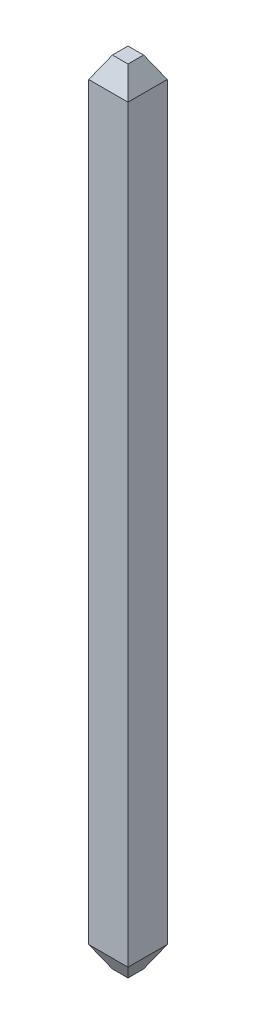
ISO-10303-21;
HEADER;
FILE_DESCRIPTION(('STEP AP214'),'2;1');
FILE_NAME('part.step','',(''),(''),'','','');
FILE_SCHEMA(('AUTOMOTIVE_DESIGN { 1 0 10303 214 1 1 1 1 }'));
ENDSEC;
DATA;
#1=APPLICATION_CONTEXT('core data for automotive mechanical design processes');
#2=APPLICATION_PROTOCOL_DEFINITION('international standard','automotive_design',2000,#1);
#3=PRODUCT_CONTEXT('',#1,'mechanical');
#4=PRODUCT('Part','Part','',(#3));
#5=PRODUCT_RELATED_PRODUCT_CATEGORY('part','',(#4));
#6=PRODUCT_DEFINITION_FORMATION('','',#4);
#7=PRODUCT_DEFINITION_CONTEXT('part definition',#1,'design');
#8=PRODUCT_DEFINITION('design','',#6,#7);
#9=PRODUCT_DEFINITION_SHAPE('','',#8);
#10=(LENGTH_UNIT() NAMED_UNIT(*) SI_UNIT(.MILLI.,.METRE.));
#11=(NAMED_UNIT(*) PLANE_ANGLE_UNIT() SI_UNIT($,.RADIAN.));
#12=(NAMED_UNIT(*) SI_UNIT($,.STERADIAN.) SOLID_ANGLE_UNIT());
#13=UNCERTAINTY_MEASURE_WITH_UNIT(LENGTH_MEASURE(1.E-05),#10,'distance_accuracy_value','');
#14=(GEOMETRIC_REPRESENTATION_CONTEXT(3) GLOBAL_UNCERTAINTY_ASSIGNED_CONTEXT((#13)) GLOBAL_UNIT_ASSIGNED_CONTEXT((#10,
#11,#12)) REPRESENTATION_CONTEXT('',''));
#15=CARTESIAN_POINT('',(0.,0.,0.));
#16=DIRECTION('',(0.,0.,1.));
#17=DIRECTION('',(1.,0.,0.));
#18=AXIS2_PLACEMENT_3D('',#15,#16,#17);
#19=CARTESIAN_POINT('',(0.497289871213,-21.22226807941,-0.290960592368));
#20=DIRECTION('',(0.,0.488489958076213,0.87256951634738));
#21=DIRECTION('',(0.,-0.87256951634738,0.488489958076213));
#22=AXIS2_PLACEMENT_3D('',#19,#20,#21);
#23=PLANE('',#22);
#24=DIRECTION('',(1.,0.,0.));
#25=VECTOR('',#24,1.);
#26=CARTESIAN_POINT('',(0.497289871213,-21.57099360271,-0.0957338361422407));
#27=LINE('',#26,#25);
#28=CARTESIAN_POINT('',(0.48728989589798,-21.5709939289415,-0.0957338361547551));
#29=VERTEX_POINT('',#28);
#30=CARTESIAN_POINT('',(-0.142710289145667,-21.5709938896675,-0.0957336754956127));
#31=VERTEX_POINT('',#30);
#32=EDGE_CURVE('E118',#29,#31,#27,.F.);
#33=ORIENTED_EDGE('',*,*,#32,.F.);
#34=DIRECTION('',(0.438284036988373,-0.784297353956832,0.439072617567397));
#35=VECTOR('',#34,1.);
#36=CARTESIAN_POINT('',(0.29728987121219,-21.2309937745705,-0.286075692787));
#37=LINE('',#36,#35);
#38=CARTESIAN_POINT('',(0.297289871212797,-21.2309937745703,-0.286075692787416));
#39=VERTEX_POINT('',#38);
#40=EDGE_CURVE('E116',#39,#29,#37,.T.);
#41=ORIENTED_EDGE('',*,*,#40,.F.);
#42=DIRECTION('',(-1.,0.,0.));
#43=VECTOR('',#42,1.);
#44=CARTESIAN_POINT('',(0.307289871213,-21.23099377457,-0.286075692787));
#45=LINE('',#44,#43);
#46=CARTESIAN_POINT('',(0.0472898712130213,-21.2309937745702,-0.286075692787416));
#47=VERTEX_POINT('',#46);
#48=EDGE_CURVE('E79',#47,#39,#45,.F.);
#49=ORIENTED_EDGE('',*,*,#48,.F.);
#50=DIRECTION('',(0.438284036988378,0.784297353956842,-0.439072617567376));
#51=VECTOR('',#50,1.);
#52=CARTESIAN_POINT('',(-0.14271012878781,-21.5709936027095,-0.0957338361422397));
#53=LINE('',#52,#51);
#54=EDGE_CURVE('E110',#31,#47,#53,.T.);
#55=ORIENTED_EDGE('',*,*,#54,.F.);
#56=EDGE_LOOP('',(#33,#41,#49,#55));
#57=FACE_BOUND('',#56,.T.);
#58=ADVANCED_FACE('F17',(#57),#23,.T.);
#59=CARTESIAN_POINT('',(0.497289871213,-33.93541112064,-0.290708664644));
#60=DIRECTION('',(0.,-0.487152273933216,0.873317045523387));
#61=DIRECTION('',(0.,-0.873317045523387,-0.487152273933216));
#62=AXIS2_PLACEMENT_3D('',#59,#60,#61);
#63=PLANE('',#62);
#64=DIRECTION('',(-0.438586917260421,-0.784839349959164,-0.437799852402531));
#65=VECTOR('',#64,1.);
#66=CARTESIAN_POINT('',(0.487290184384019,-33.5866775616409,-0.0961777932352798));
#67=LINE('',#66,#65);
#68=CARTESIAN_POINT('',(0.487289980136551,-33.5866774630266,-0.0961780382384231));
#69=VERTEX_POINT('',#68);
#70=CARTESIAN_POINT('',(0.29728987121302,-33.9266779501895,-0.285837141905986));
#71=VERTEX_POINT('',#70);
#72=EDGE_CURVE('E122',#69,#71,#67,.T.);
#73=ORIENTED_EDGE('',*,*,#72,.F.);
#74=DIRECTION('',(1.,0.,0.));
#75=VECTOR('',#74,1.);
#76=CARTESIAN_POINT('',(0.497289871213,-33.5866774970136,-0.0961771537805001));
#77=LINE('',#76,#75);
#78=CARTESIAN_POINT('',(-0.142710305819022,-33.5866774872794,-0.0961780399837927));
#79=VERTEX_POINT('',#78);
#80=EDGE_CURVE('E89',#79,#69,#77,.T.);
#81=ORIENTED_EDGE('',*,*,#80,.F.);
#82=DIRECTION('',(-0.438586917260322,0.784839349958982,0.437799852402956));
#83=VECTOR('',#82,1.);
#84=CARTESIAN_POINT('',(0.0472898712136261,-33.9266779501897,-0.285837141905));
#85=LINE('',#84,#83);
#86=CARTESIAN_POINT('',(0.0472898712132013,-33.9266779501894,-0.285837141905986));
#87=VERTEX_POINT('',#86);
#88=EDGE_CURVE('E84',#87,#79,#85,.T.);
#89=ORIENTED_EDGE('',*,*,#88,.F.);
#90=DIRECTION('',(1.,0.,0.));
#91=VECTOR('',#90,1.);
#92=CARTESIAN_POINT('',(0.03728987121306,-33.92667795019,-0.285837141905));
#93=LINE('',#92,#91);
#94=EDGE_CURVE('E20',#71,#87,#93,.F.);
#95=ORIENTED_EDGE('',*,*,#94,.F.);
#96=EDGE_LOOP('',(#73,#81,#89,#95));
#97=FACE_BOUND('',#96,.T.);
#98=ADVANCED_FACE('F86',(#97),#63,.T.);
#99=CARTESIAN_POINT('',(0.03728987121306,-33.92667795019,-0.545837141905));
#100=DIRECTION('',(0.,-1.,0.));
#101=DIRECTION('',(1.,0.,0.));
#102=AXIS2_PLACEMENT_3D('',#99,#100,#101);
#103=PLANE('',#102);
#104=DIRECTION('',(0.,0.,1.));
#105=VECTOR('',#104,1.);
#106=CARTESIAN_POINT('',(0.0472898712136262,-33.9266779501897,-0.736178998549));
#107=LINE('',#106,#105);
#108=CARTESIAN_POINT('',(0.0472898712133431,-33.9266779501896,-0.535837141904584));
#109=VERTEX_POINT('',#108);
#110=EDGE_CURVE('E93',#109,#87,#107,.T.);
#111=ORIENTED_EDGE('',*,*,#110,.F.);
#112=DIRECTION('',(1.,0.,0.));
#113=VECTOR('',#112,1.);
#114=CARTESIAN_POINT('',(0.497289871213,-33.9266779501891,-0.535837141903338));
#115=LINE('',#114,#113);
#116=CARTESIAN_POINT('',(0.29728987121304,-33.9266779501898,-0.535837141904584));
#117=VERTEX_POINT('',#116);
#118=EDGE_CURVE('E129',#117,#109,#115,.F.);
#119=ORIENTED_EDGE('',*,*,#118,.F.);
#120=DIRECTION('',(0.,0.,1.));
#121=VECTOR('',#120,1.);
#122=CARTESIAN_POINT('',(0.297289871213079,-33.92667795019,-0.736178998549));
#123=LINE('',#122,#121);
#124=EDGE_CURVE('E98',#71,#117,#123,.F.);
#125=ORIENTED_EDGE('',*,*,#124,.F.);
#126=ORIENTED_EDGE('',*,*,#94,.T.);
#127=EDGE_LOOP('',(#111,#119,#125,#126));
#128=FACE_BOUND('',#127,.T.);
#129=ADVANCED_FACE('F95',(#128),#103,.T.);
#130=CARTESIAN_POINT('',(0.05216808666874,-33.93540738396,-0.736178998549));
#131=DIRECTION('',(-0.872943377132686,-0.487821545567825,0.));
#132=DIRECTION('',(0.487821545567825,-0.872943377132686,0.));
#133=AXIS2_PLACEMENT_3D('',#130,#131,#132);
#134=PLANE('',#133);
#135=DIRECTION('',(-0.43828470044216,0.784297071672233,-0.43907245953793));
#136=VECTOR('',#135,1.);
#137=CARTESIAN_POINT('',(0.04728987121306,-33.9266779501891,-0.535837141903338));
#138=LINE('',#137,#136);
#139=CARTESIAN_POINT('',(-0.142710211258918,-33.5866782459584,-0.726178189083739));
#140=VERTEX_POINT('',#139);
#141=EDGE_CURVE('E102',#109,#140,#138,.T.);
#142=ORIENTED_EDGE('',*,*,#141,.F.);
#143=ORIENTED_EDGE('',*,*,#110,.T.);
#144=ORIENTED_EDGE('',*,*,#88,.T.);
#145=DIRECTION('',(0.,0.,1.));
#146=VECTOR('',#145,1.);
#147=CARTESIAN_POINT('',(-0.142710128787,-33.58667874778,-0.411009103414));
#148=LINE('',#147,#146);
#149=EDGE_CURVE('E131',#140,#79,#148,.T.);
#150=ORIENTED_EDGE('',*,*,#149,.F.);
#151=EDGE_LOOP('',(#142,#143,#144,#150));
#152=FACE_BOUND('',#151,.T.);
#153=ADVANCED_FACE('F100',(#152),#134,.T.);
#154=CARTESIAN_POINT('',(0.307289871213,-21.23099377457,-0.546075692787));
#155=DIRECTION('',(0.,1.,0.));
#156=DIRECTION('',(-1.,0.,0.));
#157=AXIS2_PLACEMENT_3D('',#154,#155,#156);
#158=PLANE('',#157);
#159=ORIENTED_EDGE('',*,*,#48,.T.);
#160=DIRECTION('',(0.,0.,1.));
#161=VECTOR('',#160,1.);
#162=CARTESIAN_POINT('',(0.29728987121219,-21.2309937745705,-0.735733836142));
#163=LINE('',#162,#161);
#164=CARTESIAN_POINT('',(0.297289871212797,-21.2309937745704,-0.536075692786506));
#165=VERTEX_POINT('',#164);
#166=EDGE_CURVE('E113',#165,#39,#163,.T.);
#167=ORIENTED_EDGE('',*,*,#166,.F.);
#168=DIRECTION('',(1.,0.,0.));
#169=VECTOR('',#168,1.);
#170=CARTESIAN_POINT('',(0.497289871213,-21.2309937745711,-0.536075692785025));
#171=LINE('',#170,#169);
#172=CARTESIAN_POINT('',(0.0472898712130212,-21.2309937745703,-0.536075692786506));
#173=VERTEX_POINT('',#172);
#174=EDGE_CURVE('E140',#173,#165,#171,.T.);
#175=ORIENTED_EDGE('',*,*,#174,.F.);
#176=DIRECTION('',(0.,0.,1.));
#177=VECTOR('',#176,1.);
#178=CARTESIAN_POINT('',(0.047289871212935,-21.2309937745699,-0.735733836142));
#179=LINE('',#178,#177);
#180=EDGE_CURVE('E105',#47,#173,#179,.F.);
#181=ORIENTED_EDGE('',*,*,#180,.F.);
#182=EDGE_LOOP('',(#159,#167,#175,#181));
#183=FACE_BOUND('',#182,.T.);
#184=ADVANCED_FACE('F184',(#183),#158,.T.);
#185=CARTESIAN_POINT('',(-0.147588344243,-21.57972303648,-0.735733836142));
#186=DIRECTION('',(-0.872943377132686,0.487821545567825,0.));
#187=DIRECTION('',(-0.487821545567825,-0.872943377132686,0.));
#188=AXIS2_PLACEMENT_3D('',#185,#186,#187);
#189=PLANE('',#188);
#190=DIRECTION('',(0.,0.,1.));
#191=VECTOR('',#190,1.);
#192=CARTESIAN_POINT('',(-0.142710128787008,-21.57099360271,-0.411009103414));
#193=LINE('',#192,#191);
#194=CARTESIAN_POINT('',(-0.142710835596165,-21.5709953440113,-0.725734245100736));
#195=VERTEX_POINT('',#194);
#196=EDGE_CURVE('E137',#31,#195,#193,.F.);
#197=ORIENTED_EDGE('',*,*,#196,.F.);
#198=ORIENTED_EDGE('',*,*,#54,.T.);
#199=ORIENTED_EDGE('',*,*,#180,.T.);
#200=DIRECTION('',(0.438586429090224,0.784840434712894,0.437798396819315));
#201=VECTOR('',#200,1.);
#202=CARTESIAN_POINT('',(-0.142710849418,-21.5709957406264,-0.725735028709613));
#203=LINE('',#202,#201);
#204=EDGE_CURVE('E145',#195,#173,#203,.T.);
#205=ORIENTED_EDGE('',*,*,#204,.F.);
#206=EDGE_LOOP('',(#197,#198,#199,#205));
#207=FACE_BOUND('',#206,.T.);
#208=ADVANCED_FACE('F182',(#207),#189,.T.);
#209=CARTESIAN_POINT('',(0.292411655757,-21.2222643408,-0.735733836142));
#210=DIRECTION('',(0.872943377132686,0.487821545567825,0.));
#211=DIRECTION('',(-0.487821545567825,0.872943377132686,0.));
#212=AXIS2_PLACEMENT_3D('',#209,#210,#211);
#213=PLANE('',#212);
#214=ORIENTED_EDGE('',*,*,#166,.T.);
#215=ORIENTED_EDGE('',*,*,#40,.T.);
#216=DIRECTION('',(0.,0.,1.));
#217=VECTOR('',#216,1.);
#218=CARTESIAN_POINT('',(0.487289871212996,-21.57099621256,-0.736127345931));
#219=LINE('',#218,#217);
#220=CARTESIAN_POINT('',(0.487290141449586,-21.5709947896532,-0.725733710602145));
#221=VERTEX_POINT('',#220);
#222=EDGE_CURVE('E35',#221,#29,#219,.T.);
#223=ORIENTED_EDGE('',*,*,#222,.F.);
#224=DIRECTION('',(0.438586429090131,-0.784840434712933,-0.437798396819337));
#225=VECTOR('',#224,1.);
#226=CARTESIAN_POINT('',(0.297289871213,-21.2309937745711,-0.536075692785025));
#227=LINE('',#226,#225);
#228=EDGE_CURVE('E143',#165,#221,#227,.T.);
#229=ORIENTED_EDGE('',*,*,#228,.F.);
#230=EDGE_LOOP('',(#214,#215,#223,#229));
#231=FACE_BOUND('',#230,.T.);
#232=ADVANCED_FACE('F185',(#231),#213,.T.);
#233=CARTESIAN_POINT('',(0.497289871213,-21.45033675752,-0.09572938451817));
#234=DIRECTION('',(0.,-3.68949151673241E-05,0.999999999319383));
#235=DIRECTION('',(0.,-0.999999999319383,-3.68949151673241E-05));
#236=AXIS2_PLACEMENT_3D('',#233,#234,#235);
#237=PLANE('',#236);
#238=DIRECTION('',(0.,0.999999999317418,3.6948133509763E-05));
#239=VECTOR('',#238,1.);
#240=CARTESIAN_POINT('',(-0.142710128787,-33.58667749699,-0.09617779323528));
#241=LINE('',#240,#239);
#242=EDGE_CURVE('E134',#79,#31,#241,.T.);
#243=ORIENTED_EDGE('',*,*,#242,.F.);
#244=ORIENTED_EDGE('',*,*,#80,.T.);
#245=DIRECTION('',(0.,-0.999999999317418,-3.69481335097585E-05));
#246=VECTOR('',#245,1.);
#247=CARTESIAN_POINT('',(0.487289871212996,-21.57099360271,-0.0957338361422401));
#248=LINE('',#247,#246);
#249=EDGE_CURVE('E149',#29,#69,#248,.T.);
#250=ORIENTED_EDGE('',*,*,#249,.F.);
#251=ORIENTED_EDGE('',*,*,#32,.T.);
#252=EDGE_LOOP('',(#243,#244,#250,#251));
#253=FACE_BOUND('',#252,.T.);
#254=ADVANCED_FACE('F187',(#253),#237,.T.);
#255=CARTESIAN_POINT('',(0.492168086669,-33.57794868828,-0.736178998549));
#256=DIRECTION('',(0.872943377132686,-0.487821545567825,0.));
#257=DIRECTION('',(0.487821545567825,0.872943377132686,0.));
#258=AXIS2_PLACEMENT_3D('',#255,#256,#257);
#259=PLANE('',#258);
#260=ORIENTED_EDGE('',*,*,#124,.T.);
#261=DIRECTION('',(-0.438284700442048,-0.78429707167228,0.439072459537956));
#262=VECTOR('',#261,1.);
#263=CARTESIAN_POINT('',(0.487289673578,-33.5866791127601,-0.726178443920009));
#264=LINE('',#263,#262);
#265=CARTESIAN_POINT('',(0.487289755137329,-33.5866786503075,-0.726177875184493));
#266=VERTEX_POINT('',#265);
#267=EDGE_CURVE('E126',#266,#117,#264,.T.);
#268=ORIENTED_EDGE('',*,*,#267,.F.);
#269=DIRECTION('',(0.,0.,1.));
#270=VECTOR('',#269,1.);
#271=CARTESIAN_POINT('',(0.487289871213004,-33.58667749699,-0.736127345931));
#272=LINE('',#271,#270);
#273=EDGE_CURVE('E152',#69,#266,#272,.F.);
#274=ORIENTED_EDGE('',*,*,#273,.F.);
#275=ORIENTED_EDGE('',*,*,#72,.T.);
#276=EDGE_LOOP('',(#260,#268,#274,#275));
#277=FACE_BOUND('',#276,.T.);
#278=ADVANCED_FACE('F174',(#277),#259,.T.);
#279=CARTESIAN_POINT('',(0.497289871213,-33.93540364535,-0.530952242324));
#280=DIRECTION('',(0.,-0.488489958076213,-0.87256951634738));
#281=DIRECTION('',(0.,0.87256951634738,-0.488489958076213));
#282=AXIS2_PLACEMENT_3D('',#279,#280,#281);
#283=PLANE('',#282);
#284=ORIENTED_EDGE('',*,*,#267,.T.);
#285=ORIENTED_EDGE('',*,*,#118,.T.);
#286=ORIENTED_EDGE('',*,*,#141,.T.);
#287=DIRECTION('',(1.,0.,0.));
#288=VECTOR('',#287,1.);
#289=CARTESIAN_POINT('',(0.497289871213,-33.5866787478035,-0.726177153827105));
#290=LINE('',#289,#288);
#291=EDGE_CURVE('E155',#266,#140,#290,.F.);
#292=ORIENTED_EDGE('',*,*,#291,.F.);
#293=EDGE_LOOP('',(#284,#285,#286,#292));
#294=FACE_BOUND('',#293,.T.);
#295=ADVANCED_FACE('F177',(#294),#283,.T.);
#296=CARTESIAN_POINT('',(-0.142710128787,-33.75733847732,-0.411009103414));
#297=DIRECTION('',(-1.,0.,0.));
#298=DIRECTION('',(0.,-1.,0.));
#299=AXIS2_PLACEMENT_3D('',#296,#297,#298);
#300=PLANE('',#299);
#301=ORIENTED_EDGE('',*,*,#196,.T.);
#302=DIRECTION('',(0.,0.999999999319383,3.68949151676141E-05));
#303=VECTOR('',#302,1.);
#304=CARTESIAN_POINT('',(-0.142709931152,-33.75734199129,-0.726183450433));
#305=LINE('',#304,#303);
#306=EDGE_CURVE('E158',#140,#195,#305,.T.);
#307=ORIENTED_EDGE('',*,*,#306,.F.);
#308=ORIENTED_EDGE('',*,*,#149,.T.);
#309=ORIENTED_EDGE('',*,*,#242,.T.);
#310=EDGE_LOOP('',(#301,#307,#308,#309));
#311=FACE_BOUND('',#310,.T.);
#312=ADVANCED_FACE('F179',(#311),#300,.T.);
#313=CARTESIAN_POINT('',(0.497289871213,-21.22226060412,-0.531204170048));
#314=DIRECTION('',(0.,0.487152273933216,-0.873317045523387));
#315=DIRECTION('',(0.,0.873317045523387,0.487152273933216));
#316=AXIS2_PLACEMENT_3D('',#313,#314,#315);
#317=PLANE('',#316);
#318=DIRECTION('',(1.,0.,0.));
#319=VECTOR('',#318,1.);
#320=CARTESIAN_POINT('',(0.497289871213,-21.5709962125728,-0.725733836238985));
#321=LINE('',#320,#319);
#322=EDGE_CURVE('E26',#195,#221,#321,.T.);
#323=ORIENTED_EDGE('',*,*,#322,.F.);
#324=ORIENTED_EDGE('',*,*,#204,.T.);
#325=ORIENTED_EDGE('',*,*,#174,.T.);
#326=ORIENTED_EDGE('',*,*,#228,.T.);
#327=EDGE_LOOP('',(#323,#324,#325,#326));
#328=FACE_BOUND('',#327,.T.);
#329=ADVANCED_FACE('F168',(#328),#317,.T.);
#330=CARTESIAN_POINT('',(0.487289871213,-27.60384299983,-0.736127345931));
#331=DIRECTION('',(1.,0.,0.));
#332=DIRECTION('',(0.,1.,0.));
#333=AXIS2_PLACEMENT_3D('',#330,#331,#332);
#334=PLANE('',#333);
#335=ORIENTED_EDGE('',*,*,#249,.T.);
#336=ORIENTED_EDGE('',*,*,#273,.T.);
#337=DIRECTION('',(0.,0.999999999319383,3.68949151676141E-05));
#338=VECTOR('',#337,1.);
#339=CARTESIAN_POINT('',(0.487290591844,-33.75734199129,-0.726183450433));
#340=LINE('',#339,#338);
#341=EDGE_CURVE('E11',#221,#266,#340,.F.);
#342=ORIENTED_EDGE('',*,*,#341,.F.);
#343=ORIENTED_EDGE('',*,*,#222,.T.);
#344=EDGE_LOOP('',(#335,#336,#342,#343));
#345=FACE_BOUND('',#344,.T.);
#346=ADVANCED_FACE('F170',(#345),#334,.T.);
#347=CARTESIAN_POINT('',(0.497289871213,-33.75734199129,-0.726183450433));
#348=DIRECTION('',(0.,3.68949151676141E-05,-0.999999999319383));
#349=DIRECTION('',(0.,0.999999999319383,3.68949151676141E-05));
#350=AXIS2_PLACEMENT_3D('',#347,#348,#349);
#351=PLANE('',#350);
#352=ORIENTED_EDGE('',*,*,#322,.T.);
#353=ORIENTED_EDGE('',*,*,#341,.T.);
#354=ORIENTED_EDGE('',*,*,#291,.T.);
#355=ORIENTED_EDGE('',*,*,#306,.T.);
#356=EDGE_LOOP('',(#352,#353,#354,#355));
#357=FACE_BOUND('',#356,.T.);
#358=ADVANCED_FACE('F164',(#357),#351,.T.);
#359=CLOSED_SHELL('',(#58,#98,#129,#153,#184,#208,#232,#254,#278,#295,#312,#329,#346,#358));
#360=MANIFOLD_SOLID_BREP('B1',#359);
#361=ADVANCED_BREP_SHAPE_REPRESENTATION('',(#18,#360),#14);
#362=SHAPE_DEFINITION_REPRESENTATION(#9,#361);
ENDSEC;
END-ISO-10303-21;
